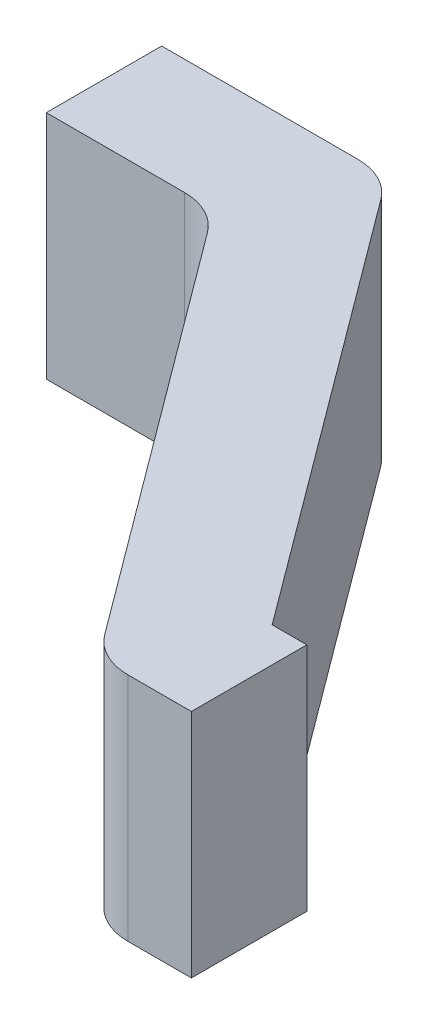
ISO-10303-21;
HEADER;
FILE_DESCRIPTION(('STEP AP214'),'2;1');
FILE_NAME('part.step','',(''),(''),'','','');
FILE_SCHEMA(('AUTOMOTIVE_DESIGN { 1 0 10303 214 1 1 1 1 }'));
ENDSEC;
DATA;
#1=APPLICATION_CONTEXT('core data for automotive mechanical design processes');
#2=APPLICATION_PROTOCOL_DEFINITION('international standard','automotive_design',2000,#1);
#3=PRODUCT_CONTEXT('',#1,'mechanical');
#4=PRODUCT('Part','Part','',(#3));
#5=PRODUCT_RELATED_PRODUCT_CATEGORY('part','',(#4));
#6=PRODUCT_DEFINITION_FORMATION('','',#4);
#7=PRODUCT_DEFINITION_CONTEXT('part definition',#1,'design');
#8=PRODUCT_DEFINITION('design','',#6,#7);
#9=PRODUCT_DEFINITION_SHAPE('','',#8);
#10=(LENGTH_UNIT() NAMED_UNIT(*) SI_UNIT(.MILLI.,.METRE.));
#11=(NAMED_UNIT(*) PLANE_ANGLE_UNIT() SI_UNIT($,.RADIAN.));
#12=(NAMED_UNIT(*) SI_UNIT($,.STERADIAN.) SOLID_ANGLE_UNIT());
#13=UNCERTAINTY_MEASURE_WITH_UNIT(LENGTH_MEASURE(1.E-05),#10,'distance_accuracy_value','');
#14=(GEOMETRIC_REPRESENTATION_CONTEXT(3) GLOBAL_UNCERTAINTY_ASSIGNED_CONTEXT((#13)) GLOBAL_UNIT_ASSIGNED_CONTEXT((#10,
#11,#12)) REPRESENTATION_CONTEXT('',''));
#15=CARTESIAN_POINT('',(0.,0.,0.));
#16=DIRECTION('',(0.,0.,1.));
#17=DIRECTION('',(1.,0.,0.));
#18=AXIS2_PLACEMENT_3D('',#15,#16,#17);
#19=CARTESIAN_POINT('',(-3.,0.43,0.205));
#20=DIRECTION('',(0.,0.,1.));
#21=DIRECTION('',(1.,0.,0.));
#22=AXIS2_PLACEMENT_3D('',#19,#20,#21);
#23=PLANE('',#22);
#24=DIRECTION('',(1.,0.,0.));
#25=VECTOR('',#24,1.);
#26=CARTESIAN_POINT('',(-3.,0.84,0.205));
#27=LINE('',#26,#25);
#28=CARTESIAN_POINT('',(-3.,0.84,0.205));
#29=VERTEX_POINT('',#28);
#30=CARTESIAN_POINT('',(-2.754632601552,0.84,0.205));
#31=VERTEX_POINT('',#30);
#32=EDGE_CURVE('E11',#29,#31,#27,.T.);
#33=ORIENTED_EDGE('',*,*,#32,.F.);
#34=DIRECTION('',(0.,1.,0.));
#35=VECTOR('',#34,1.);
#36=CARTESIAN_POINT('',(-3.,0.43,0.205));
#37=LINE('',#36,#35);
#38=CARTESIAN_POINT('',(-3.,0.43,0.205));
#39=VERTEX_POINT('',#38);
#40=EDGE_CURVE('E24',#39,#29,#37,.T.);
#41=ORIENTED_EDGE('',*,*,#40,.F.);
#42=DIRECTION('',(1.,0.,0.));
#43=VECTOR('',#42,1.);
#44=CARTESIAN_POINT('',(-3.,0.43,0.205));
#45=LINE('',#44,#43);
#46=CARTESIAN_POINT('',(-2.754632601552,0.43,0.205));
#47=VERTEX_POINT('',#46);
#48=EDGE_CURVE('E186',#39,#47,#45,.T.);
#49=ORIENTED_EDGE('',*,*,#48,.T.);
#50=DIRECTION('',(0.,1.,0.));
#51=VECTOR('',#50,1.);
#52=CARTESIAN_POINT('',(-2.754632601552,0.43,0.205));
#53=LINE('',#52,#51);
#54=EDGE_CURVE('E184',#47,#31,#53,.T.);
#55=ORIENTED_EDGE('',*,*,#54,.T.);
#56=EDGE_LOOP('',(#33,#41,#49,#55));
#57=FACE_BOUND('',#56,.T.);
#58=ADVANCED_FACE('F17',(#57),#23,.T.);
#59=CARTESIAN_POINT('',(-3.,0.84,0.));
#60=DIRECTION('',(0.,1.,0.));
#61=DIRECTION('',(0.,0.,1.));
#62=AXIS2_PLACEMENT_3D('',#59,#60,#61);
#63=PLANE('',#62);
#64=DIRECTION('',(1.,0.,0.));
#65=VECTOR('',#64,1.);
#66=CARTESIAN_POINT('',(-3.,0.84,0.));
#67=LINE('',#66,#65);
#68=CARTESIAN_POINT('',(-3.,0.84,0.));
#69=VERTEX_POINT('',#68);
#70=CARTESIAN_POINT('',(-2.651544200517,0.84,0.));
#71=VERTEX_POINT('',#70);
#72=EDGE_CURVE('E182',#69,#71,#67,.T.);
#73=ORIENTED_EDGE('',*,*,#72,.F.);
#74=DIRECTION('',(0.,0.,1.));
#75=VECTOR('',#74,1.);
#76=CARTESIAN_POINT('',(-3.,0.84,0.));
#77=LINE('',#76,#75);
#78=EDGE_CURVE('E180',#69,#29,#77,.T.);
#79=ORIENTED_EDGE('',*,*,#78,.T.);
#80=ORIENTED_EDGE('',*,*,#32,.T.);
#81=CARTESIAN_POINT('',(-2.754632601552,0.84,0.3075));
#82=DIRECTION('',(0.,-1.,0.));
#83=DIRECTION('',(0.,0.,1.));
#84=AXIS2_PLACEMENT_3D('',#81,#82,#83);
#85=CIRCLE('',#84,0.1025);
#86=CARTESIAN_POINT('',(-2.672351357136,0.84,0.246376789863));
#87=VERTEX_POINT('',#86);
#88=EDGE_CURVE('E178',#31,#87,#85,.T.);
#89=ORIENTED_EDGE('',*,*,#88,.T.);
#90=DIRECTION('',(0.596324001338072,0.,0.802743847954097));
#91=VECTOR('',#90,1.);
#92=CARTESIAN_POINT('',(-2.764562488831,0.84,0.122246420274));
#93=LINE('',#92,#91);
#94=CARTESIAN_POINT('',(-2.145299532729,0.84,0.955869630411));
#95=VERTEX_POINT('',#94);
#96=EDGE_CURVE('E176',#87,#95,#93,.T.);
#97=ORIENTED_EDGE('',*,*,#96,.T.);
#98=CARTESIAN_POINT('',(-2.063018288313,0.84,0.894746420274));
#99=DIRECTION('',(0.,1.,0.));
#100=DIRECTION('',(0.,0.,1.));
#101=AXIS2_PLACEMENT_3D('',#98,#99,#100);
#102=CIRCLE('',#101,0.1025);
#103=CARTESIAN_POINT('',(-2.063018288313,0.84,0.997246420274));
#104=VERTEX_POINT('',#103);
#105=EDGE_CURVE('E120',#95,#104,#102,.T.);
#106=ORIENTED_EDGE('',*,*,#105,.T.);
#107=DIRECTION('',(1.,0.,0.));
#108=VECTOR('',#107,1.);
#109=CARTESIAN_POINT('',(-2.114562488831,0.84,0.997246420274));
#110=LINE('',#109,#108);
#111=CARTESIAN_POINT('',(-1.95,0.84,0.997246420274));
#112=VERTEX_POINT('',#111);
#113=EDGE_CURVE('E173',#104,#112,#110,.T.);
#114=ORIENTED_EDGE('',*,*,#113,.T.);
#115=DIRECTION('',(0.,0.,1.));
#116=VECTOR('',#115,1.);
#117=CARTESIAN_POINT('',(-1.95,0.84,0.792246420274));
#118=LINE('',#117,#116);
#119=CARTESIAN_POINT('',(-1.95,0.84,0.792246420274));
#120=VERTEX_POINT('',#119);
#121=EDGE_CURVE('E170',#120,#112,#118,.T.);
#122=ORIENTED_EDGE('',*,*,#121,.F.);
#123=DIRECTION('',(1.,0.,0.));
#124=VECTOR('',#123,1.);
#125=CARTESIAN_POINT('',(-2.114562488831,0.84,0.792246420274));
#126=LINE('',#125,#124);
#127=CARTESIAN_POINT('',(-2.011474087796,0.84,0.792246420274));
#128=VERTEX_POINT('',#127);
#129=EDGE_CURVE('E167',#128,#120,#126,.T.);
#130=ORIENTED_EDGE('',*,*,#129,.F.);
#131=DIRECTION('',(0.596324001338072,0.,0.802743847954097));
#132=VECTOR('',#131,1.);
#133=CARTESIAN_POINT('',(-2.6,0.84,0.));
#134=LINE('',#133,#132);
#135=CARTESIAN_POINT('',(-2.569262956102,0.84,0.0413767898629));
#136=VERTEX_POINT('',#135);
#137=EDGE_CURVE('E164',#136,#128,#134,.T.);
#138=ORIENTED_EDGE('',*,*,#137,.F.);
#139=CARTESIAN_POINT('',(-2.651544200517,0.84,0.1025));
#140=DIRECTION('',(0.,-1.,0.));
#141=DIRECTION('',(0.,0.,1.));
#142=AXIS2_PLACEMENT_3D('',#139,#140,#141);
#143=CIRCLE('',#142,0.1025);
#144=EDGE_CURVE('E161',#71,#136,#143,.T.);
#145=ORIENTED_EDGE('',*,*,#144,.F.);
#146=EDGE_LOOP('',(#73,#79,#80,#89,#97,#106,#114,#122,#130,#138,#145));
#147=FACE_BOUND('',#146,.T.);
#148=ADVANCED_FACE('F192',(#147),#63,.T.);
#149=CARTESIAN_POINT('',(-2.754632601552,0.43,0.3075));
#150=DIRECTION('',(0.,1.,0.));
#151=DIRECTION('',(0.,0.,-1.));
#152=AXIS2_PLACEMENT_3D('',#149,#150,#151);
#153=CYLINDRICAL_SURFACE('',#152,0.1025);
#154=CARTESIAN_POINT('',(-2.754632601552,0.43,0.3075));
#155=DIRECTION('',(0.,-1.,0.));
#156=DIRECTION('',(0.,0.,1.));
#157=AXIS2_PLACEMENT_3D('',#154,#155,#156);
#158=CIRCLE('',#157,0.1025);
#159=CARTESIAN_POINT('',(-2.672351357136,0.43,0.246376789863));
#160=VERTEX_POINT('',#159);
#161=EDGE_CURVE('E159',#47,#160,#158,.T.);
#162=ORIENTED_EDGE('',*,*,#161,.T.);
#163=DIRECTION('',(0.,1.,0.));
#164=VECTOR('',#163,1.);
#165=CARTESIAN_POINT('',(-2.672351357136,0.43,0.246376789863));
#166=LINE('',#165,#164);
#167=EDGE_CURVE('E102',#160,#87,#166,.T.);
#168=ORIENTED_EDGE('',*,*,#167,.T.);
#169=ORIENTED_EDGE('',*,*,#88,.F.);
#170=ORIENTED_EDGE('',*,*,#54,.F.);
#171=EDGE_LOOP('',(#162,#168,#169,#170));
#172=FACE_BOUND('',#171,.T.);
#173=ADVANCED_FACE('F216',(#172),#153,.F.);
#174=CARTESIAN_POINT('',(-3.,0.43,0.));
#175=DIRECTION('',(1.,0.,0.));
#176=DIRECTION('',(0.,0.,1.));
#177=AXIS2_PLACEMENT_3D('',#174,#175,#176);
#178=PLANE('',#177);
#179=ORIENTED_EDGE('',*,*,#40,.T.);
#180=ORIENTED_EDGE('',*,*,#78,.F.);
#181=DIRECTION('',(0.,1.,0.));
#182=VECTOR('',#181,1.);
#183=CARTESIAN_POINT('',(-3.,0.43,0.));
#184=LINE('',#183,#182);
#185=CARTESIAN_POINT('',(-3.,0.43,0.));
#186=VERTEX_POINT('',#185);
#187=EDGE_CURVE('E155',#186,#69,#184,.T.);
#188=ORIENTED_EDGE('',*,*,#187,.F.);
#189=DIRECTION('',(0.,0.,1.));
#190=VECTOR('',#189,1.);
#191=CARTESIAN_POINT('',(-3.,0.43,0.));
#192=LINE('',#191,#190);
#193=EDGE_CURVE('E152',#186,#39,#192,.T.);
#194=ORIENTED_EDGE('',*,*,#193,.T.);
#195=EDGE_LOOP('',(#179,#180,#188,#194));
#196=FACE_BOUND('',#195,.T.);
#197=ADVANCED_FACE('F189',(#196),#178,.F.);
#198=CARTESIAN_POINT('',(-3.,0.43,0.));
#199=DIRECTION('',(0.,1.,0.));
#200=DIRECTION('',(0.,0.,1.));
#201=AXIS2_PLACEMENT_3D('',#198,#199,#200);
#202=PLANE('',#201);
#203=CARTESIAN_POINT('',(-2.651544200517,0.43,0.1025));
#204=DIRECTION('',(0.,-1.,0.));
#205=DIRECTION('',(0.,0.,1.));
#206=AXIS2_PLACEMENT_3D('',#203,#204,#205);
#207=CIRCLE('',#206,0.1025);
#208=CARTESIAN_POINT('',(-2.651544200517,0.43,0.));
#209=VERTEX_POINT('',#208);
#210=CARTESIAN_POINT('',(-2.569262956102,0.43,0.0413767898629));
#211=VERTEX_POINT('',#210);
#212=EDGE_CURVE('E150',#209,#211,#207,.T.);
#213=ORIENTED_EDGE('',*,*,#212,.T.);
#214=DIRECTION('',(0.596324001338072,0.,0.802743847954097));
#215=VECTOR('',#214,1.);
#216=CARTESIAN_POINT('',(-2.6,0.43,0.));
#217=LINE('',#216,#215);
#218=CARTESIAN_POINT('',(-2.011474087796,0.43,0.792246420274));
#219=VERTEX_POINT('',#218);
#220=EDGE_CURVE('E147',#211,#219,#217,.T.);
#221=ORIENTED_EDGE('',*,*,#220,.T.);
#222=DIRECTION('',(1.,0.,0.));
#223=VECTOR('',#222,1.);
#224=CARTESIAN_POINT('',(-2.114562488831,0.43,0.792246420274));
#225=LINE('',#224,#223);
#226=CARTESIAN_POINT('',(-1.95,0.43,0.792246420274));
#227=VERTEX_POINT('',#226);
#228=EDGE_CURVE('E144',#219,#227,#225,.T.);
#229=ORIENTED_EDGE('',*,*,#228,.T.);
#230=DIRECTION('',(0.,0.,1.));
#231=VECTOR('',#230,1.);
#232=CARTESIAN_POINT('',(-1.95,0.43,0.792246420274));
#233=LINE('',#232,#231);
#234=CARTESIAN_POINT('',(-1.95,0.43,0.997246420274));
#235=VERTEX_POINT('',#234);
#236=EDGE_CURVE('E142',#227,#235,#233,.T.);
#237=ORIENTED_EDGE('',*,*,#236,.T.);
#238=DIRECTION('',(1.,0.,0.));
#239=VECTOR('',#238,1.);
#240=CARTESIAN_POINT('',(-2.114562488831,0.43,0.997246420274));
#241=LINE('',#240,#239);
#242=CARTESIAN_POINT('',(-2.063018288313,0.43,0.997246420274));
#243=VERTEX_POINT('',#242);
#244=EDGE_CURVE('E113',#243,#235,#241,.T.);
#245=ORIENTED_EDGE('',*,*,#244,.F.);
#246=CARTESIAN_POINT('',(-2.063018288313,0.43,0.894746420274));
#247=DIRECTION('',(0.,1.,0.));
#248=DIRECTION('',(0.,0.,1.));
#249=AXIS2_PLACEMENT_3D('',#246,#247,#248);
#250=CIRCLE('',#249,0.1025);
#251=CARTESIAN_POINT('',(-2.145299532729,0.43,0.955869630411));
#252=VERTEX_POINT('',#251);
#253=EDGE_CURVE('E106',#252,#243,#250,.T.);
#254=ORIENTED_EDGE('',*,*,#253,.F.);
#255=DIRECTION('',(0.596324001338072,0.,0.802743847954097));
#256=VECTOR('',#255,1.);
#257=CARTESIAN_POINT('',(-2.764562488831,0.43,0.122246420274));
#258=LINE('',#257,#256);
#259=EDGE_CURVE('E95',#160,#252,#258,.T.);
#260=ORIENTED_EDGE('',*,*,#259,.F.);
#261=ORIENTED_EDGE('',*,*,#161,.F.);
#262=ORIENTED_EDGE('',*,*,#48,.F.);
#263=ORIENTED_EDGE('',*,*,#193,.F.);
#264=DIRECTION('',(1.,0.,0.));
#265=VECTOR('',#264,1.);
#266=CARTESIAN_POINT('',(-3.,0.43,0.));
#267=LINE('',#266,#265);
#268=EDGE_CURVE('E107',#186,#209,#267,.T.);
#269=ORIENTED_EDGE('',*,*,#268,.T.);
#270=EDGE_LOOP('',(#213,#221,#229,#237,#245,#254,#260,#261,#262,#263,#269));
#271=FACE_BOUND('',#270,.T.);
#272=ADVANCED_FACE('F111',(#271),#202,.F.);
#273=CARTESIAN_POINT('',(-3.,0.43,0.));
#274=DIRECTION('',(0.,0.,1.));
#275=DIRECTION('',(1.,0.,0.));
#276=AXIS2_PLACEMENT_3D('',#273,#274,#275);
#277=PLANE('',#276);
#278=DIRECTION('',(0.,1.,0.));
#279=VECTOR('',#278,1.);
#280=CARTESIAN_POINT('',(-2.651544200517,0.43,0.));
#281=LINE('',#280,#279);
#282=EDGE_CURVE('E137',#209,#71,#281,.T.);
#283=ORIENTED_EDGE('',*,*,#282,.F.);
#284=ORIENTED_EDGE('',*,*,#268,.F.);
#285=ORIENTED_EDGE('',*,*,#187,.T.);
#286=ORIENTED_EDGE('',*,*,#72,.T.);
#287=EDGE_LOOP('',(#283,#284,#285,#286));
#288=FACE_BOUND('',#287,.T.);
#289=ADVANCED_FACE('F196',(#288),#277,.F.);
#290=CARTESIAN_POINT('',(-2.651544200517,0.43,0.1025));
#291=DIRECTION('',(0.,1.,0.));
#292=DIRECTION('',(0.,0.,-1.));
#293=AXIS2_PLACEMENT_3D('',#290,#291,#292);
#294=CYLINDRICAL_SURFACE('',#293,0.1025);
#295=ORIENTED_EDGE('',*,*,#282,.T.);
#296=ORIENTED_EDGE('',*,*,#144,.T.);
#297=DIRECTION('',(0.,1.,0.));
#298=VECTOR('',#297,1.);
#299=CARTESIAN_POINT('',(-2.569262956102,0.43,0.0413767898629));
#300=LINE('',#299,#298);
#301=EDGE_CURVE('E134',#211,#136,#300,.T.);
#302=ORIENTED_EDGE('',*,*,#301,.F.);
#303=ORIENTED_EDGE('',*,*,#212,.F.);
#304=EDGE_LOOP('',(#295,#296,#302,#303));
#305=FACE_BOUND('',#304,.T.);
#306=ADVANCED_FACE('F201',(#305),#294,.T.);
#307=CARTESIAN_POINT('',(-2.6,0.43,0.));
#308=DIRECTION('',(0.802743847954097,0.,-0.596324001338072));
#309=DIRECTION('',(0.596324001338072,0.,0.802743847954097));
#310=AXIS2_PLACEMENT_3D('',#307,#308,#309);
#311=PLANE('',#310);
#312=ORIENTED_EDGE('',*,*,#220,.F.);
#313=ORIENTED_EDGE('',*,*,#301,.T.);
#314=ORIENTED_EDGE('',*,*,#137,.T.);
#315=DIRECTION('',(0.,1.,0.));
#316=VECTOR('',#315,1.);
#317=CARTESIAN_POINT('',(-2.011474087796,0.43,0.792246420274));
#318=LINE('',#317,#316);
#319=EDGE_CURVE('E131',#219,#128,#318,.T.);
#320=ORIENTED_EDGE('',*,*,#319,.F.);
#321=EDGE_LOOP('',(#312,#313,#314,#320));
#322=FACE_BOUND('',#321,.T.);
#323=ADVANCED_FACE('F203',(#322),#311,.T.);
#324=CARTESIAN_POINT('',(-2.114562488831,0.43,0.792246420274));
#325=DIRECTION('',(0.,0.,1.));
#326=DIRECTION('',(1.,0.,0.));
#327=AXIS2_PLACEMENT_3D('',#324,#325,#326);
#328=PLANE('',#327);
#329=DIRECTION('',(0.,1.,0.));
#330=VECTOR('',#329,1.);
#331=CARTESIAN_POINT('',(-1.95,0.43,0.792246420274));
#332=LINE('',#331,#330);
#333=EDGE_CURVE('E125',#227,#120,#332,.T.);
#334=ORIENTED_EDGE('',*,*,#333,.F.);
#335=ORIENTED_EDGE('',*,*,#228,.F.);
#336=ORIENTED_EDGE('',*,*,#319,.T.);
#337=ORIENTED_EDGE('',*,*,#129,.T.);
#338=EDGE_LOOP('',(#334,#335,#336,#337));
#339=FACE_BOUND('',#338,.T.);
#340=ADVANCED_FACE('F208',(#339),#328,.F.);
#341=CARTESIAN_POINT('',(-1.95,0.43,0.792246420274));
#342=DIRECTION('',(1.,0.,0.));
#343=DIRECTION('',(0.,0.,1.));
#344=AXIS2_PLACEMENT_3D('',#341,#342,#343);
#345=PLANE('',#344);
#346=ORIENTED_EDGE('',*,*,#236,.F.);
#347=ORIENTED_EDGE('',*,*,#333,.T.);
#348=ORIENTED_EDGE('',*,*,#121,.T.);
#349=DIRECTION('',(0.,1.,0.));
#350=VECTOR('',#349,1.);
#351=CARTESIAN_POINT('',(-1.95,0.43,0.997246420274));
#352=LINE('',#351,#350);
#353=EDGE_CURVE('E121',#235,#112,#352,.T.);
#354=ORIENTED_EDGE('',*,*,#353,.F.);
#355=EDGE_LOOP('',(#346,#347,#348,#354));
#356=FACE_BOUND('',#355,.T.);
#357=ADVANCED_FACE('F210',(#356),#345,.T.);
#358=CARTESIAN_POINT('',(-2.764562488831,0.43,0.122246420274));
#359=DIRECTION('',(0.802743847954097,0.,-0.596324001338072));
#360=DIRECTION('',(0.596324001338072,0.,0.802743847954097));
#361=AXIS2_PLACEMENT_3D('',#358,#359,#360);
#362=PLANE('',#361);
#363=DIRECTION('',(0.,1.,0.));
#364=VECTOR('',#363,1.);
#365=CARTESIAN_POINT('',(-2.145299532729,0.43,0.955869630411));
#366=LINE('',#365,#364);
#367=EDGE_CURVE('E100',#252,#95,#366,.T.);
#368=ORIENTED_EDGE('',*,*,#367,.T.);
#369=ORIENTED_EDGE('',*,*,#96,.F.);
#370=ORIENTED_EDGE('',*,*,#167,.F.);
#371=ORIENTED_EDGE('',*,*,#259,.T.);
#372=EDGE_LOOP('',(#368,#369,#370,#371));
#373=FACE_BOUND('',#372,.T.);
#374=ADVANCED_FACE('F97',(#373),#362,.F.);
#375=CARTESIAN_POINT('',(-2.114562488831,0.43,0.997246420274));
#376=DIRECTION('',(0.,0.,1.));
#377=DIRECTION('',(1.,0.,0.));
#378=AXIS2_PLACEMENT_3D('',#375,#376,#377);
#379=PLANE('',#378);
#380=ORIENTED_EDGE('',*,*,#244,.T.);
#381=ORIENTED_EDGE('',*,*,#353,.T.);
#382=ORIENTED_EDGE('',*,*,#113,.F.);
#383=DIRECTION('',(0.,1.,0.));
#384=VECTOR('',#383,1.);
#385=CARTESIAN_POINT('',(-2.063018288313,0.43,0.997246420274));
#386=LINE('',#385,#384);
#387=EDGE_CURVE('E122',#243,#104,#386,.T.);
#388=ORIENTED_EDGE('',*,*,#387,.F.);
#389=EDGE_LOOP('',(#380,#381,#382,#388));
#390=FACE_BOUND('',#389,.T.);
#391=ADVANCED_FACE('F213',(#390),#379,.T.);
#392=CARTESIAN_POINT('',(-2.063018288313,0.43,0.894746420274));
#393=DIRECTION('',(0.,1.,0.));
#394=DIRECTION('',(-0.802743847954097,0.,0.596324001338072));
#395=AXIS2_PLACEMENT_3D('',#392,#393,#394);
#396=CYLINDRICAL_SURFACE('',#395,0.1025);
#397=ORIENTED_EDGE('',*,*,#253,.T.);
#398=ORIENTED_EDGE('',*,*,#387,.T.);
#399=ORIENTED_EDGE('',*,*,#105,.F.);
#400=ORIENTED_EDGE('',*,*,#367,.F.);
#401=EDGE_LOOP('',(#397,#398,#399,#400));
#402=FACE_BOUND('',#401,.T.);
#403=ADVANCED_FACE('F119',(#402),#396,.T.);
#404=CLOSED_SHELL('',(#58,#148,#173,#197,#272,#289,#306,#323,#340,#357,#374,#391,#403));
#405=MANIFOLD_SOLID_BREP('B1',#404);
#406=ADVANCED_BREP_SHAPE_REPRESENTATION('',(#18,#405),#14);
#407=SHAPE_DEFINITION_REPRESENTATION(#9,#406);
ENDSEC;
END-ISO-10303-21;
